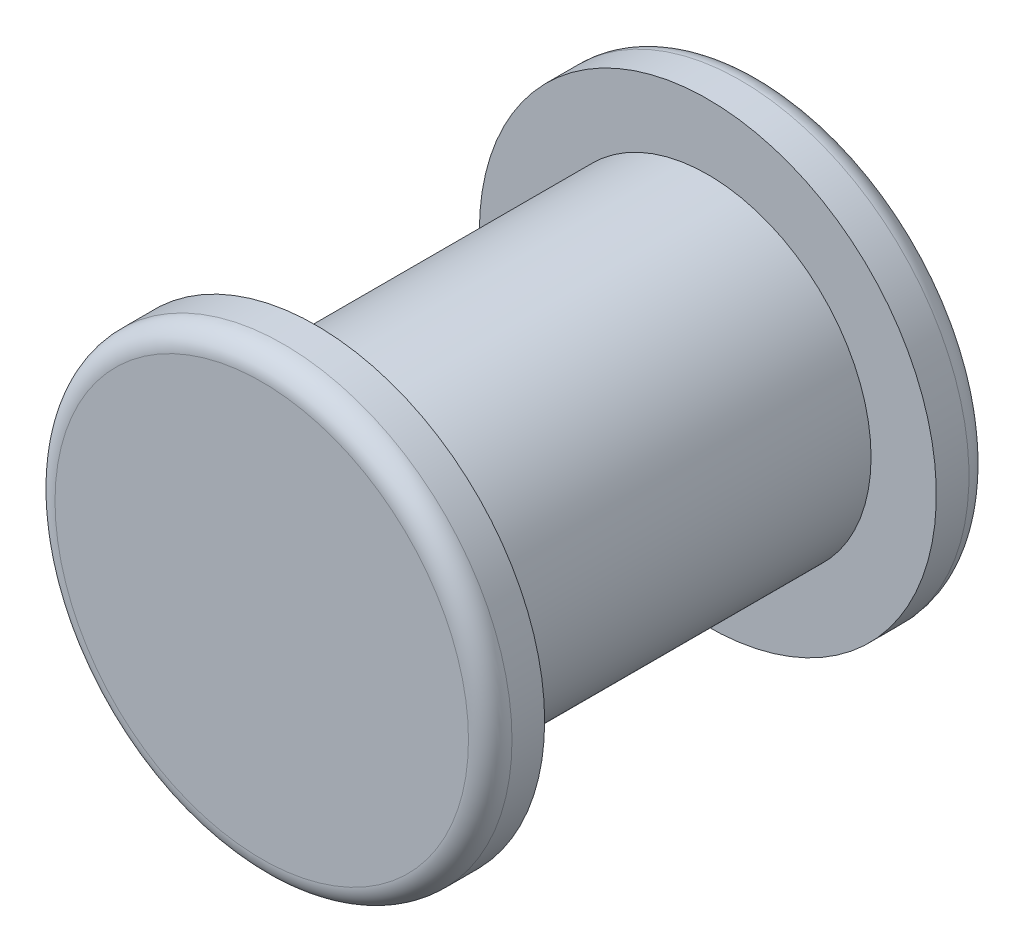
ISO-10303-21;
HEADER;
FILE_DESCRIPTION(('STEP AP214'),'2;1');
FILE_NAME('part.step','',(''),(''),'','','');
FILE_SCHEMA(('AUTOMOTIVE_DESIGN { 1 0 10303 214 1 1 1 1 }'));
ENDSEC;
DATA;
#1=APPLICATION_CONTEXT('core data for automotive mechanical design processes');
#2=APPLICATION_PROTOCOL_DEFINITION('international standard','automotive_design',2000,#1);
#3=PRODUCT_CONTEXT('',#1,'mechanical');
#4=PRODUCT('Part','Part','',(#3));
#5=PRODUCT_RELATED_PRODUCT_CATEGORY('part','',(#4));
#6=PRODUCT_DEFINITION_FORMATION('','',#4);
#7=PRODUCT_DEFINITION_CONTEXT('part definition',#1,'design');
#8=PRODUCT_DEFINITION('design','',#6,#7);
#9=PRODUCT_DEFINITION_SHAPE('','',#8);
#10=(LENGTH_UNIT() NAMED_UNIT(*) SI_UNIT(.MILLI.,.METRE.));
#11=(NAMED_UNIT(*) PLANE_ANGLE_UNIT() SI_UNIT($,.RADIAN.));
#12=(NAMED_UNIT(*) SI_UNIT($,.STERADIAN.) SOLID_ANGLE_UNIT());
#13=UNCERTAINTY_MEASURE_WITH_UNIT(LENGTH_MEASURE(1.E-05),#10,'distance_accuracy_value','');
#14=(GEOMETRIC_REPRESENTATION_CONTEXT(3) GLOBAL_UNCERTAINTY_ASSIGNED_CONTEXT((#13)) GLOBAL_UNIT_ASSIGNED_CONTEXT((#10,
#11,#12)) REPRESENTATION_CONTEXT('',''));
#15=CARTESIAN_POINT('',(0.,0.,0.));
#16=DIRECTION('',(0.,0.,1.));
#17=DIRECTION('',(1.,0.,0.));
#18=AXIS2_PLACEMENT_3D('',#15,#16,#17);
#19=CARTESIAN_POINT('',(0.,0.,180.));
#20=DIRECTION('',(0.,0.,-1.));
#21=DIRECTION('',(-1.,0.,0.));
#22=AXIS2_PLACEMENT_3D('',#19,#20,#21);
#23=CYLINDRICAL_SURFACE('',#22,75.);
#24=CARTESIAN_POINT('',(0.,0.,180.));
#25=DIRECTION('',(0.,0.,1.));
#26=DIRECTION('',(1.,0.,0.));
#27=AXIS2_PLACEMENT_3D('',#24,#25,#26);
#28=CIRCLE('',#27,75.);
#29=CARTESIAN_POINT('',(75.,0.,180.));
#30=VERTEX_POINT('',#29);
#31=EDGE_CURVE('E59',#30,#30,#28,.T.);
#32=ORIENTED_EDGE('',*,*,#31,.F.);
#33=EDGE_LOOP('',(#32));
#34=FACE_BOUND('',#33,.T.);
#35=CARTESIAN_POINT('',(0.,0.,0.));
#36=DIRECTION('',(0.,0.,1.));
#37=DIRECTION('',(1.,0.,0.));
#38=AXIS2_PLACEMENT_3D('',#35,#36,#37);
#39=CIRCLE('',#38,75.);
#40=CARTESIAN_POINT('',(75.,0.,0.));
#41=VERTEX_POINT('',#40);
#42=EDGE_CURVE('E60',#41,#41,#39,.T.);
#43=ORIENTED_EDGE('',*,*,#42,.T.);
#44=EDGE_LOOP('',(#43));
#45=FACE_BOUND('',#44,.T.);
#46=ADVANCED_FACE('F39',(#34,#45),#23,.T.);
#47=CARTESIAN_POINT('',(0.,0.,205.));
#48=DIRECTION('',(0.,0.,-1.));
#49=DIRECTION('',(-1.,0.,0.));
#50=AXIS2_PLACEMENT_3D('',#47,#48,#49);
#51=CYLINDRICAL_SURFACE('',#50,105.);
#52=CARTESIAN_POINT('',(0.,0.,195.));
#53=DIRECTION('',(0.,0.,1.));
#54=DIRECTION('',(1.,0.,0.));
#55=AXIS2_PLACEMENT_3D('',#52,#53,#54);
#56=CIRCLE('',#55,105.);
#57=CARTESIAN_POINT('',(105.,0.,195.));
#58=VERTEX_POINT('',#57);
#59=EDGE_CURVE('E50',#58,#58,#56,.F.);
#60=ORIENTED_EDGE('',*,*,#59,.T.);
#61=EDGE_LOOP('',(#60));
#62=FACE_BOUND('',#61,.T.);
#63=CARTESIAN_POINT('',(0.,0.,180.));
#64=DIRECTION('',(0.,0.,1.));
#65=DIRECTION('',(1.,0.,0.));
#66=AXIS2_PLACEMENT_3D('',#63,#64,#65);
#67=CIRCLE('',#66,105.);
#68=CARTESIAN_POINT('',(105.,0.,180.));
#69=VERTEX_POINT('',#68);
#70=EDGE_CURVE('E63',#69,#69,#67,.T.);
#71=ORIENTED_EDGE('',*,*,#70,.T.);
#72=EDGE_LOOP('',(#71));
#73=FACE_BOUND('',#72,.T.);
#74=ADVANCED_FACE('F91',(#62,#73),#51,.T.);
#75=CARTESIAN_POINT('',(0.,0.,205.));
#76=DIRECTION('',(0.,0.,1.));
#77=DIRECTION('',(1.,0.,0.));
#78=AXIS2_PLACEMENT_3D('',#75,#76,#77);
#79=PLANE('',#78);
#80=CARTESIAN_POINT('',(0.,0.,205.));
#81=DIRECTION('',(0.,0.,1.));
#82=DIRECTION('',(1.,0.,0.));
#83=AXIS2_PLACEMENT_3D('',#80,#81,#82);
#84=CIRCLE('',#83,95.);
#85=CARTESIAN_POINT('',(95.,0.,205.));
#86=VERTEX_POINT('',#85);
#87=EDGE_CURVE('E54',#86,#86,#84,.T.);
#88=ORIENTED_EDGE('',*,*,#87,.T.);
#89=EDGE_LOOP('',(#88));
#90=FACE_BOUND('',#89,.T.);
#91=ADVANCED_FACE('F96',(#90),#79,.T.);
#92=CARTESIAN_POINT('',(0.,0.,180.));
#93=DIRECTION('',(0.,0.,1.));
#94=DIRECTION('',(1.,0.,0.));
#95=AXIS2_PLACEMENT_3D('',#92,#93,#94);
#96=PLANE('',#95);
#97=ORIENTED_EDGE('',*,*,#31,.T.);
#98=EDGE_LOOP('',(#97));
#99=FACE_BOUND('',#98,.T.);
#100=ORIENTED_EDGE('',*,*,#70,.F.);
#101=EDGE_LOOP('',(#100));
#102=FACE_BOUND('',#101,.T.);
#103=ADVANCED_FACE('F102',(#99,#102),#96,.F.);
#104=CARTESIAN_POINT('',(0.,0.,-25.));
#105=DIRECTION('',(0.,0.,1.));
#106=DIRECTION('',(1.,0.,0.));
#107=AXIS2_PLACEMENT_3D('',#104,#105,#106);
#108=CYLINDRICAL_SURFACE('',#107,105.);
#109=CARTESIAN_POINT('',(0.,0.,-15.));
#110=DIRECTION('',(0.,0.,-1.));
#111=DIRECTION('',(-1.,0.,0.));
#112=AXIS2_PLACEMENT_3D('',#109,#110,#111);
#113=CIRCLE('',#112,105.);
#114=CARTESIAN_POINT('',(-105.,0.,-15.));
#115=VERTEX_POINT('',#114);
#116=EDGE_CURVE('E10',#115,#115,#113,.F.);
#117=ORIENTED_EDGE('',*,*,#116,.T.);
#118=EDGE_LOOP('',(#117));
#119=FACE_BOUND('',#118,.T.);
#120=CARTESIAN_POINT('',(0.,0.,0.));
#121=DIRECTION('',(0.,0.,-1.));
#122=DIRECTION('',(-1.,0.,0.));
#123=AXIS2_PLACEMENT_3D('',#120,#121,#122);
#124=CIRCLE('',#123,105.);
#125=CARTESIAN_POINT('',(-105.,0.,0.));
#126=VERTEX_POINT('',#125);
#127=EDGE_CURVE('E64',#126,#126,#124,.T.);
#128=ORIENTED_EDGE('',*,*,#127,.T.);
#129=EDGE_LOOP('',(#128));
#130=FACE_BOUND('',#129,.T.);
#131=ADVANCED_FACE('F72',(#119,#130),#108,.T.);
#132=CARTESIAN_POINT('',(0.,0.,-25.));
#133=DIRECTION('',(0.,0.,-1.));
#134=DIRECTION('',(-1.,0.,0.));
#135=AXIS2_PLACEMENT_3D('',#132,#133,#134);
#136=PLANE('',#135);
#137=CARTESIAN_POINT('',(0.,0.,-25.));
#138=DIRECTION('',(0.,0.,-1.));
#139=DIRECTION('',(-1.,0.,0.));
#140=AXIS2_PLACEMENT_3D('',#137,#138,#139);
#141=CIRCLE('',#140,95.);
#142=CARTESIAN_POINT('',(-95.,0.,-25.));
#143=VERTEX_POINT('',#142);
#144=EDGE_CURVE('E46',#143,#143,#141,.T.);
#145=ORIENTED_EDGE('',*,*,#144,.T.);
#146=EDGE_LOOP('',(#145));
#147=FACE_BOUND('',#146,.T.);
#148=ADVANCED_FACE('F77',(#147),#136,.T.);
#149=CARTESIAN_POINT('',(0.,0.,0.));
#150=DIRECTION('',(0.,0.,-1.));
#151=DIRECTION('',(-1.,0.,0.));
#152=AXIS2_PLACEMENT_3D('',#149,#150,#151);
#153=PLANE('',#152);
#154=ORIENTED_EDGE('',*,*,#42,.F.);
#155=EDGE_LOOP('',(#154));
#156=FACE_BOUND('',#155,.T.);
#157=ORIENTED_EDGE('',*,*,#127,.F.);
#158=EDGE_LOOP('',(#157));
#159=FACE_BOUND('',#158,.T.);
#160=ADVANCED_FACE('F74',(#156,#159),#153,.F.);
#161=CARTESIAN_POINT('',(0.,0.,195.));
#162=DIRECTION('',(0.,0.,1.));
#163=DIRECTION('',(1.,0.,0.));
#164=AXIS2_PLACEMENT_3D('',#161,#162,#163);
#165=TOROIDAL_SURFACE('',#164,95.,10.);
#166=ORIENTED_EDGE('',*,*,#59,.F.);
#167=EDGE_LOOP('',(#166));
#168=FACE_BOUND('',#167,.T.);
#169=ORIENTED_EDGE('',*,*,#87,.F.);
#170=EDGE_LOOP('',(#169));
#171=FACE_BOUND('',#170,.T.);
#172=ADVANCED_FACE('F76',(#168,#171),#165,.T.);
#173=CARTESIAN_POINT('',(0.,0.,-15.));
#174=DIRECTION('',(0.,0.,-1.));
#175=DIRECTION('',(-1.,0.,0.));
#176=AXIS2_PLACEMENT_3D('',#173,#174,#175);
#177=TOROIDAL_SURFACE('',#176,95.,10.);
#178=ORIENTED_EDGE('',*,*,#116,.F.);
#179=EDGE_LOOP('',(#178));
#180=FACE_BOUND('',#179,.T.);
#181=ORIENTED_EDGE('',*,*,#144,.F.);
#182=EDGE_LOOP('',(#181));
#183=FACE_BOUND('',#182,.T.);
#184=ADVANCED_FACE('F41',(#180,#183),#177,.T.);
#185=CLOSED_SHELL('',(#46,#74,#91,#103,#131,#148,#160,#172,#184));
#186=MANIFOLD_SOLID_BREP('B2',#185);
#187=ADVANCED_BREP_SHAPE_REPRESENTATION('',(#18,#186),#14);
#188=SHAPE_DEFINITION_REPRESENTATION(#9,#187);
ENDSEC;
END-ISO-10303-21;
